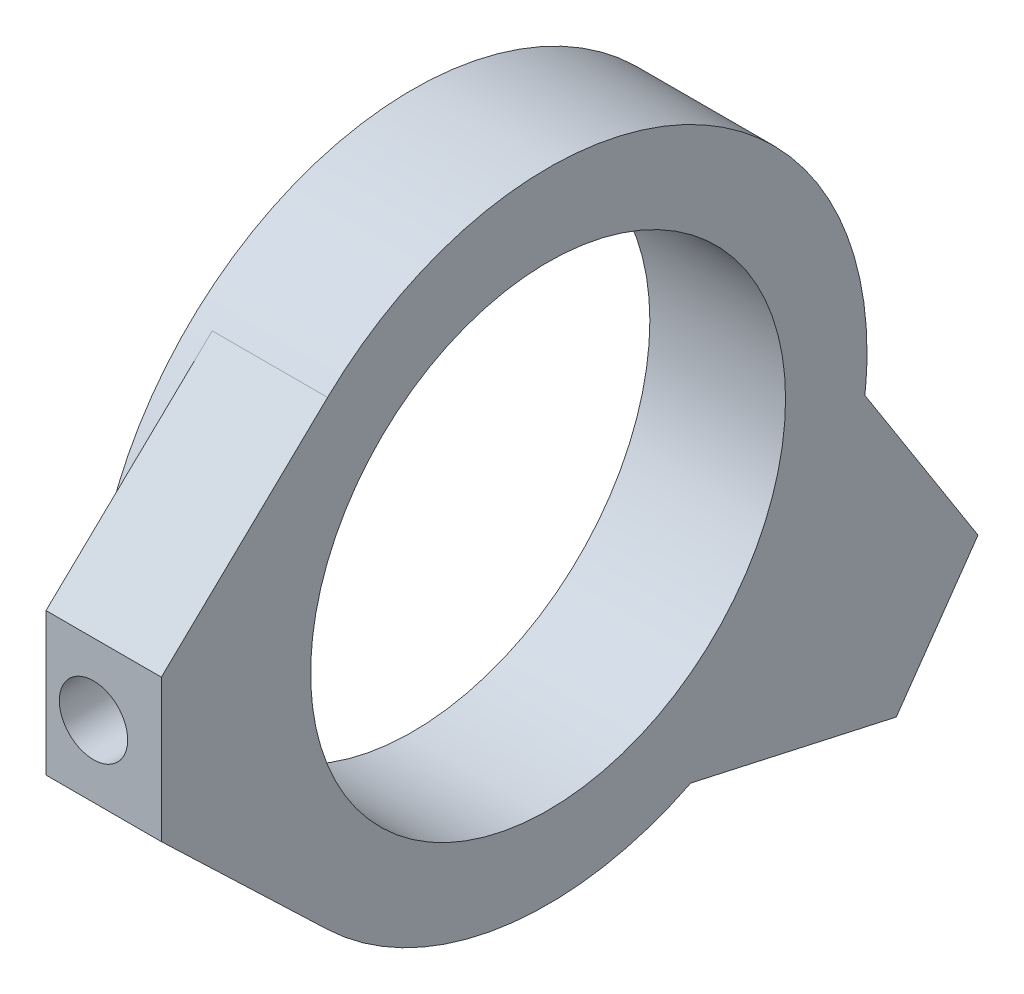
ISO-10303-21;
HEADER;
FILE_DESCRIPTION(('STEP AP214'),'2;1');
FILE_NAME('part.step','',(''),(''),'','','');
FILE_SCHEMA(('AUTOMOTIVE_DESIGN { 1 0 10303 214 1 1 1 1 }'));
ENDSEC;
DATA;
#1=APPLICATION_CONTEXT('core data for automotive mechanical design processes');
#2=APPLICATION_PROTOCOL_DEFINITION('international standard','automotive_design',2000,#1);
#3=PRODUCT_CONTEXT('',#1,'mechanical');
#4=PRODUCT('Part','Part','',(#3));
#5=PRODUCT_RELATED_PRODUCT_CATEGORY('part','',(#4));
#6=PRODUCT_DEFINITION_FORMATION('','',#4);
#7=PRODUCT_DEFINITION_CONTEXT('part definition',#1,'design');
#8=PRODUCT_DEFINITION('design','',#6,#7);
#9=PRODUCT_DEFINITION_SHAPE('','',#8);
#10=(LENGTH_UNIT() NAMED_UNIT(*) SI_UNIT(.MILLI.,.METRE.));
#11=(NAMED_UNIT(*) PLANE_ANGLE_UNIT() SI_UNIT($,.RADIAN.));
#12=(NAMED_UNIT(*) SI_UNIT($,.STERADIAN.) SOLID_ANGLE_UNIT());
#13=UNCERTAINTY_MEASURE_WITH_UNIT(LENGTH_MEASURE(1.E-05),#10,'distance_accuracy_value','');
#14=(GEOMETRIC_REPRESENTATION_CONTEXT(3) GLOBAL_UNCERTAINTY_ASSIGNED_CONTEXT((#13)) GLOBAL_UNIT_ASSIGNED_CONTEXT((#10,
#11,#12)) REPRESENTATION_CONTEXT('',''));
#15=CARTESIAN_POINT('',(0.,0.,0.));
#16=DIRECTION('',(0.,0.,1.));
#17=DIRECTION('',(1.,0.,0.));
#18=AXIS2_PLACEMENT_3D('',#15,#16,#17);
#19=CARTESIAN_POINT('',(124.,109.,97.1));
#20=DIRECTION('',(-1.,0.,0.));
#21=DIRECTION('',(0.,-1.,0.));
#22=AXIS2_PLACEMENT_3D('',#19,#20,#21);
#23=CONICAL_SURFACE('',#22,29.5,0.321750554396647);
#24=CARTESIAN_POINT('',(124.,109.,97.1));
#25=DIRECTION('',(-1.,0.,0.));
#26=DIRECTION('',(0.,-1.,0.));
#27=AXIS2_PLACEMENT_3D('',#24,#25,#26);
#28=CIRCLE('',#27,29.5);
#29=CARTESIAN_POINT('',(124.,99.2513146979725,69.257350433516));
#30=VERTEX_POINT('',#29);
#31=CARTESIAN_POINT('',(124.,86.170714403484,78.4164853640246));
#32=VERTEX_POINT('',#31);
#33=EDGE_CURVE('E19',#30,#32,#28,.T.);
#34=ORIENTED_EDGE('',*,*,#33,.T.);
#35=CARTESIAN_POINT('',(125.5,86.309172831118,79.0410309709572));
#36=CARTESIAN_POINT('',(124.76049302439,86.2405353199829,78.7314271658099));
#37=CARTESIAN_POINT('',(124.,86.170714403484,78.4164853640246));
#38=B_SPLINE_CURVE_WITH_KNOTS('',2,(#35,#36,#37),.UNSPECIFIED.,.F.,.F.,(3,3),(0.,1.),.UNSPECIFIED.);
#39=CARTESIAN_POINT('',(125.5,86.309172831118,79.0410309709572));
#40=VERTEX_POINT('',#39);
#41=EDGE_CURVE('E76',#40,#32,#38,.T.);
#42=ORIENTED_EDGE('',*,*,#41,.F.);
#43=CARTESIAN_POINT('',(125.5,109.,97.1));
#44=DIRECTION('',(-1.,0.,0.));
#45=DIRECTION('',(0.,-1.,0.));
#46=AXIS2_PLACEMENT_3D('',#43,#44,#45);
#47=CIRCLE('',#46,29.);
#48=CARTESIAN_POINT('',(125.5,99.7908400248872,69.6010659742458));
#49=VERTEX_POINT('',#48);
#50=EDGE_CURVE('E123',#49,#40,#47,.T.);
#51=ORIENTED_EDGE('',*,*,#50,.F.);
#52=CARTESIAN_POINT('',(124.,99.2513146979725,69.257350433516));
#53=CARTESIAN_POINT('',(124.760493024394,99.5233830252203,69.4306770737132));
#54=CARTESIAN_POINT('',(125.5,99.7908400248872,69.6010659742458));
#55=B_SPLINE_CURVE_WITH_KNOTS('',2,(#52,#53,#54),.UNSPECIFIED.,.F.,.F.,(3,3),(0.,1.),.UNSPECIFIED.);
#56=EDGE_CURVE('E201',#30,#49,#55,.T.);
#57=ORIENTED_EDGE('',*,*,#56,.F.);
#58=EDGE_LOOP('',(#34,#42,#51,#57));
#59=FACE_BOUND('',#58,.T.);
#60=ADVANCED_FACE('F16',(#59),#23,.F.);
#61=CARTESIAN_POINT('',(124.,108.562138247598,95.5092010795212));
#62=DIRECTION('',(1.,0.,0.));
#63=DIRECTION('',(0.,0.,-1.));
#64=AXIS2_PLACEMENT_3D('',#61,#62,#63);
#65=PLANE('',#64);
#66=DIRECTION('',(0.,0.843391445812876,0.53729960834684));
#67=VECTOR('',#66,1.);
#68=CARTESIAN_POINT('',(124.,93.2253729602315,65.4184021590424));
#69=LINE('',#68,#67);
#70=CARTESIAN_POINT('',(124.,93.2253729602315,65.4184021590424));
#71=VERTEX_POINT('',#70);
#72=EDGE_CURVE('E212',#71,#30,#69,.T.);
#73=ORIENTED_EDGE('',*,*,#72,.F.);
#74=DIRECTION('',(0.,0.819152044289003,-0.57357643635103));
#75=VECTOR('',#74,1.);
#76=CARTESIAN_POINT('',(124.,84.624276495197,71.4409547407282));
#77=LINE('',#76,#75);
#78=CARTESIAN_POINT('',(124.,84.624276495197,71.4409547407282));
#79=VERTEX_POINT('',#78);
#80=EDGE_CURVE('E144',#79,#71,#77,.T.);
#81=ORIENTED_EDGE('',*,*,#80,.F.);
#82=DIRECTION('',(0.,-0.216439613938084,-0.976296007119938));
#83=VECTOR('',#82,1.);
#84=CARTESIAN_POINT('',(124.,87.982266672573,86.5878695890335));
#85=LINE('',#84,#83);
#86=EDGE_CURVE('E83',#32,#79,#85,.T.);
#87=ORIENTED_EDGE('',*,*,#86,.F.);
#88=ORIENTED_EDGE('',*,*,#33,.F.);
#89=EDGE_LOOP('',(#73,#81,#87,#88));
#90=FACE_BOUND('',#89,.T.);
#91=ADVANCED_FACE('F290',(#90),#65,.F.);
#92=CARTESIAN_POINT('',(125.5,96.3097448101109,78.0944677816397));
#93=DIRECTION('',(-1.,0.,0.));
#94=DIRECTION('',(0.,0.,1.));
#95=AXIS2_PLACEMENT_3D('',#92,#93,#94);
#96=PLANE('',#95);
#97=DIRECTION('',(0.,-0.216439613938084,-0.976296007119938));
#98=VECTOR('',#97,1.);
#99=CARTESIAN_POINT('',(125.5,87.982266672573,86.5878695890335));
#100=LINE('',#99,#98);
#101=CARTESIAN_POINT('',(125.5,87.982266672573,86.5878695890335));
#102=VERTEX_POINT('',#101);
#103=EDGE_CURVE('E147',#102,#40,#100,.T.);
#104=ORIENTED_EDGE('',*,*,#103,.F.);
#105=CARTESIAN_POINT('',(125.5,109.,97.1));
#106=DIRECTION('',(1.,0.,0.));
#107=DIRECTION('',(0.,0.,-1.));
#108=AXIS2_PLACEMENT_3D('',#105,#106,#107);
#109=CIRCLE('',#108,23.5);
#110=CARTESIAN_POINT('',(125.5,106.310316789104,73.7544307367538));
#111=VERTEX_POINT('',#110);
#112=EDGE_CURVE('E195',#111,#102,#109,.F.);
#113=ORIENTED_EDGE('',*,*,#112,.F.);
#114=DIRECTION('',(0.,0.843391445812876,0.53729960834684));
#115=VECTOR('',#114,1.);
#116=CARTESIAN_POINT('',(125.5,93.2253729602315,65.4184021590424));
#117=LINE('',#116,#115);
#118=EDGE_CURVE('E278',#49,#111,#117,.T.);
#119=ORIENTED_EDGE('',*,*,#118,.F.);
#120=ORIENTED_EDGE('',*,*,#50,.T.);
#121=EDGE_LOOP('',(#104,#113,#119,#120));
#122=FACE_BOUND('',#121,.T.);
#123=ADVANCED_FACE('F292',(#122),#96,.T.);
#124=CARTESIAN_POINT('',(125.5,109.,119.475011669298));
#125=DIRECTION('',(-1.,0.,0.));
#126=DIRECTION('',(0.,0.,1.));
#127=AXIS2_PLACEMENT_3D('',#124,#125,#126);
#128=PLANE('',#127);
#129=CARTESIAN_POINT('',(125.5,109.,97.1));
#130=DIRECTION('',(1.,0.,0.));
#131=DIRECTION('',(0.,0.,-1.));
#132=AXIS2_PLACEMENT_3D('',#129,#130,#131);
#133=CIRCLE('',#132,23.5);
#134=CARTESIAN_POINT('',(125.5,92.0239362190439,113.350023338596));
#135=VERTEX_POINT('',#134);
#136=CARTESIAN_POINT('',(125.5,125.976063780956,113.350023338596));
#137=VERTEX_POINT('',#136);
#138=EDGE_CURVE('E119',#135,#137,#133,.F.);
#139=ORIENTED_EDGE('',*,*,#138,.F.);
#140=DIRECTION('',(0.,-0.691490354833863,-0.722385692806646));
#141=VECTOR('',#140,1.);
#142=CARTESIAN_POINT('',(125.5,103.75,125.6));
#143=LINE('',#142,#141);
#144=CARTESIAN_POINT('',(125.5,103.75,125.6));
#145=VERTEX_POINT('',#144);
#146=EDGE_CURVE('E117',#145,#135,#143,.T.);
#147=ORIENTED_EDGE('',*,*,#146,.F.);
#148=DIRECTION('',(0.,-1.,0.));
#149=VECTOR('',#148,1.);
#150=CARTESIAN_POINT('',(125.5,114.25,125.6));
#151=LINE('',#150,#149);
#152=CARTESIAN_POINT('',(125.5,114.25,125.6));
#153=VERTEX_POINT('',#152);
#154=EDGE_CURVE('E105',#153,#145,#151,.T.);
#155=ORIENTED_EDGE('',*,*,#154,.F.);
#156=DIRECTION('',(0.,-0.691490354833863,0.722385692806646));
#157=VECTOR('',#156,1.);
#158=CARTESIAN_POINT('',(125.5,125.976063780956,113.350023338596));
#159=LINE('',#158,#157);
#160=EDGE_CURVE('E136',#137,#153,#159,.T.);
#161=ORIENTED_EDGE('',*,*,#160,.F.);
#162=EDGE_LOOP('',(#139,#147,#155,#161));
#163=FACE_BOUND('',#162,.T.);
#164=ADVANCED_FACE('F118',(#163),#128,.T.);
#165=CARTESIAN_POINT('',(124.,103.75,125.6));
#166=DIRECTION('',(0.,-0.722385692806646,0.691490354833863));
#167=DIRECTION('',(0.,-0.691490354833863,-0.722385692806646));
#168=AXIS2_PLACEMENT_3D('',#165,#166,#167);
#169=PLANE('',#168);
#170=DIRECTION('',(0.,-0.691490354833871,-0.722385692806639));
#171=VECTOR('',#170,1.);
#172=CARTESIAN_POINT('',(134.,103.75,125.6));
#173=LINE('',#172,#171);
#174=CARTESIAN_POINT('',(134.,103.75,125.6));
#175=VERTEX_POINT('',#174);
#176=CARTESIAN_POINT('',(134.,92.0239362190439,113.350023338596));
#177=VERTEX_POINT('',#176);
#178=EDGE_CURVE('E127',#175,#177,#173,.T.);
#179=ORIENTED_EDGE('',*,*,#178,.F.);
#180=DIRECTION('',(1.,0.,0.));
#181=VECTOR('',#180,1.);
#182=CARTESIAN_POINT('',(124.,103.75,125.6));
#183=LINE('',#182,#181);
#184=EDGE_CURVE('E110',#145,#175,#183,.T.);
#185=ORIENTED_EDGE('',*,*,#184,.F.);
#186=ORIENTED_EDGE('',*,*,#146,.T.);
#187=DIRECTION('',(1.,0.,0.));
#188=VECTOR('',#187,1.);
#189=CARTESIAN_POINT('',(124.,92.0239362190439,113.350023338596));
#190=LINE('',#189,#188);
#191=EDGE_CURVE('E194',#177,#135,#190,.F.);
#192=ORIENTED_EDGE('',*,*,#191,.F.);
#193=EDGE_LOOP('',(#179,#185,#186,#192));
#194=FACE_BOUND('',#193,.T.);
#195=ADVANCED_FACE('F126',(#194),#169,.T.);
#196=CARTESIAN_POINT('',(124.,87.982266672573,86.5878695890335));
#197=DIRECTION('',(0.,-0.976296007119938,0.216439613938084));
#198=DIRECTION('',(0.,-0.216439613938084,-0.976296007119938));
#199=AXIS2_PLACEMENT_3D('',#196,#197,#198);
#200=PLANE('',#199);
#201=DIRECTION('',(1.,0.,0.));
#202=VECTOR('',#201,1.);
#203=CARTESIAN_POINT('',(124.,87.9822666725731,86.5878695890335));
#204=LINE('',#203,#202);
#205=CARTESIAN_POINT('',(134.,87.982266672573,86.5878695890335));
#206=VERTEX_POINT('',#205);
#207=EDGE_CURVE('E196',#102,#206,#204,.T.);
#208=ORIENTED_EDGE('',*,*,#207,.F.);
#209=ORIENTED_EDGE('',*,*,#103,.T.);
#210=ORIENTED_EDGE('',*,*,#41,.T.);
#211=ORIENTED_EDGE('',*,*,#86,.T.);
#212=DIRECTION('',(1.,0.,0.));
#213=VECTOR('',#212,1.);
#214=CARTESIAN_POINT('',(124.,84.624276495197,71.4409547407282));
#215=LINE('',#214,#213);
#216=CARTESIAN_POINT('',(134.,84.624276495197,71.4409547407282));
#217=VERTEX_POINT('',#216);
#218=EDGE_CURVE('E146',#217,#79,#215,.F.);
#219=ORIENTED_EDGE('',*,*,#218,.F.);
#220=DIRECTION('',(0.,-0.21643961393808,-0.976296007119938));
#221=VECTOR('',#220,1.);
#222=CARTESIAN_POINT('',(134.,87.982266672573,86.5878695890335));
#223=LINE('',#222,#221);
#224=EDGE_CURVE('E189',#206,#217,#223,.T.);
#225=ORIENTED_EDGE('',*,*,#224,.F.);
#226=EDGE_LOOP('',(#208,#209,#210,#211,#219,#225));
#227=FACE_BOUND('',#226,.T.);
#228=ADVANCED_FACE('F229',(#227),#200,.T.);
#229=CARTESIAN_POINT('',(124.,84.624276495197,71.4409547407282));
#230=DIRECTION('',(0.,-0.57357643635103,-0.819152044289003));
#231=DIRECTION('',(0.,0.819152044289003,-0.57357643635103));
#232=AXIS2_PLACEMENT_3D('',#229,#230,#231);
#233=PLANE('',#232);
#234=DIRECTION('',(0.,0.819152044289003,-0.57357643635103));
#235=VECTOR('',#234,1.);
#236=CARTESIAN_POINT('',(134.,84.624276495197,71.4409547407282));
#237=LINE('',#236,#235);
#238=CARTESIAN_POINT('',(134.,93.2253729602315,65.4184021590424));
#239=VERTEX_POINT('',#238);
#240=EDGE_CURVE('E256',#217,#239,#237,.T.);
#241=ORIENTED_EDGE('',*,*,#240,.F.);
#242=ORIENTED_EDGE('',*,*,#218,.T.);
#243=ORIENTED_EDGE('',*,*,#80,.T.);
#244=DIRECTION('',(1.,0.,0.));
#245=VECTOR('',#244,1.);
#246=CARTESIAN_POINT('',(124.,93.2253729602315,65.4184021590424));
#247=LINE('',#246,#245);
#248=EDGE_CURVE('E280',#239,#71,#247,.F.);
#249=ORIENTED_EDGE('',*,*,#248,.F.);
#250=EDGE_LOOP('',(#241,#242,#243,#249));
#251=FACE_BOUND('',#250,.T.);
#252=ADVANCED_FACE('F225',(#251),#233,.T.);
#253=CARTESIAN_POINT('',(124.,93.2253729602315,65.4184021590424));
#254=DIRECTION('',(0.,0.53729960834684,-0.843391445812876));
#255=DIRECTION('',(0.,0.843391445812876,0.53729960834684));
#256=AXIS2_PLACEMENT_3D('',#253,#254,#255);
#257=PLANE('',#256);
#258=ORIENTED_EDGE('',*,*,#248,.T.);
#259=ORIENTED_EDGE('',*,*,#72,.T.);
#260=ORIENTED_EDGE('',*,*,#56,.T.);
#261=ORIENTED_EDGE('',*,*,#118,.T.);
#262=DIRECTION('',(1.,0.,0.));
#263=VECTOR('',#262,1.);
#264=CARTESIAN_POINT('',(124.,106.310316789104,73.7544307367538));
#265=LINE('',#264,#263);
#266=CARTESIAN_POINT('',(134.,106.310316789104,73.7544307367538));
#267=VERTEX_POINT('',#266);
#268=EDGE_CURVE('E197',#267,#111,#265,.F.);
#269=ORIENTED_EDGE('',*,*,#268,.F.);
#270=DIRECTION('',(0.,0.84339144581288,0.537299608346833));
#271=VECTOR('',#270,1.);
#272=CARTESIAN_POINT('',(134.,93.2253729602315,65.4184021590424));
#273=LINE('',#272,#271);
#274=EDGE_CURVE('E185',#239,#267,#273,.T.);
#275=ORIENTED_EDGE('',*,*,#274,.F.);
#276=EDGE_LOOP('',(#258,#259,#260,#261,#269,#275));
#277=FACE_BOUND('',#276,.T.);
#278=ADVANCED_FACE('F214',(#277),#257,.T.);
#279=CARTESIAN_POINT('',(124.,109.,97.1));
#280=DIRECTION('',(1.,0.,0.));
#281=DIRECTION('',(0.,0.,-1.));
#282=AXIS2_PLACEMENT_3D('',#279,#280,#281);
#283=CYLINDRICAL_SURFACE('',#282,23.5);
#284=CARTESIAN_POINT('',(124.,109.,97.1));
#285=DIRECTION('',(1.,0.,0.));
#286=DIRECTION('',(0.,0.,-1.));
#287=AXIS2_PLACEMENT_3D('',#284,#285,#286);
#288=CIRCLE('',#287,23.5);
#289=CARTESIAN_POINT('',(124.,109.,73.6));
#290=VERTEX_POINT('',#289);
#291=EDGE_CURVE('E129',#290,#290,#288,.T.);
#292=ORIENTED_EDGE('',*,*,#291,.T.);
#293=EDGE_LOOP('',(#292));
#294=FACE_BOUND('',#293,.T.);
#295=ORIENTED_EDGE('',*,*,#191,.T.);
#296=ORIENTED_EDGE('',*,*,#138,.T.);
#297=DIRECTION('',(1.,0.,0.));
#298=VECTOR('',#297,1.);
#299=CARTESIAN_POINT('',(124.,125.976063780956,113.350023338596));
#300=LINE('',#299,#298);
#301=CARTESIAN_POINT('',(134.,125.976063780956,113.350023338596));
#302=VERTEX_POINT('',#301);
#303=EDGE_CURVE('E114',#302,#137,#300,.F.);
#304=ORIENTED_EDGE('',*,*,#303,.F.);
#305=CARTESIAN_POINT('',(134.,109.,97.1));
#306=DIRECTION('',(1.,0.,0.));
#307=DIRECTION('',(0.,0.,-1.));
#308=AXIS2_PLACEMENT_3D('',#305,#306,#307);
#309=CIRCLE('',#308,23.5);
#310=EDGE_CURVE('E34',#267,#302,#309,.T.);
#311=ORIENTED_EDGE('',*,*,#310,.F.);
#312=ORIENTED_EDGE('',*,*,#268,.T.);
#313=ORIENTED_EDGE('',*,*,#112,.T.);
#314=ORIENTED_EDGE('',*,*,#207,.T.);
#315=CARTESIAN_POINT('',(134.,109.,97.1));
#316=DIRECTION('',(1.,0.,0.));
#317=DIRECTION('',(0.,0.,-1.));
#318=AXIS2_PLACEMENT_3D('',#315,#316,#317);
#319=CIRCLE('',#318,23.5);
#320=EDGE_CURVE('E186',#177,#206,#319,.T.);
#321=ORIENTED_EDGE('',*,*,#320,.F.);
#322=EDGE_LOOP('',(#295,#296,#304,#311,#312,#313,#314,#321));
#323=FACE_BOUND('',#322,.T.);
#324=ADVANCED_FACE('F224',(#294,#323),#283,.T.);
#325=CARTESIAN_POINT('',(124.,125.976063780956,113.350023338596));
#326=DIRECTION('',(0.,0.722385692806646,0.691490354833863));
#327=DIRECTION('',(0.,-0.691490354833863,0.722385692806646));
#328=AXIS2_PLACEMENT_3D('',#325,#326,#327);
#329=PLANE('',#328);
#330=DIRECTION('',(0.,-0.691490354833865,0.722385692806645));
#331=VECTOR('',#330,1.);
#332=CARTESIAN_POINT('',(134.,125.976063780956,113.350023338596));
#333=LINE('',#332,#331);
#334=CARTESIAN_POINT('',(134.,114.25,125.6));
#335=VERTEX_POINT('',#334);
#336=EDGE_CURVE('E181',#302,#335,#333,.T.);
#337=ORIENTED_EDGE('',*,*,#336,.F.);
#338=ORIENTED_EDGE('',*,*,#303,.T.);
#339=ORIENTED_EDGE('',*,*,#160,.T.);
#340=DIRECTION('',(1.,0.,0.));
#341=VECTOR('',#340,1.);
#342=CARTESIAN_POINT('',(124.,114.25,125.6));
#343=LINE('',#342,#341);
#344=EDGE_CURVE('E101',#335,#153,#343,.F.);
#345=ORIENTED_EDGE('',*,*,#344,.F.);
#346=EDGE_LOOP('',(#337,#338,#339,#345));
#347=FACE_BOUND('',#346,.T.);
#348=ADVANCED_FACE('F324',(#347),#329,.T.);
#349=CARTESIAN_POINT('',(124.,114.25,125.6));
#350=DIRECTION('',(0.,0.,1.));
#351=DIRECTION('',(0.,-1.,0.));
#352=AXIS2_PLACEMENT_3D('',#349,#350,#351);
#353=PLANE('',#352);
#354=CARTESIAN_POINT('',(129.,109.,125.6));
#355=DIRECTION('',(0.,0.,-1.));
#356=DIRECTION('',(0.,1.,0.));
#357=AXIS2_PLACEMENT_3D('',#354,#355,#356);
#358=CIRCLE('',#357,2.5175);
#359=CARTESIAN_POINT('',(129.,111.5175,125.6));
#360=VERTEX_POINT('',#359);
#361=EDGE_CURVE('E178',#360,#360,#358,.T.);
#362=ORIENTED_EDGE('',*,*,#361,.T.);
#363=EDGE_LOOP('',(#362));
#364=FACE_BOUND('',#363,.T.);
#365=DIRECTION('',(0.,1.,0.));
#366=VECTOR('',#365,1.);
#367=CARTESIAN_POINT('',(134.,108.562138247598,125.6));
#368=LINE('',#367,#366);
#369=EDGE_CURVE('E192',#335,#175,#368,.F.);
#370=ORIENTED_EDGE('',*,*,#369,.F.);
#371=ORIENTED_EDGE('',*,*,#344,.T.);
#372=ORIENTED_EDGE('',*,*,#154,.T.);
#373=ORIENTED_EDGE('',*,*,#184,.T.);
#374=EDGE_LOOP('',(#370,#371,#372,#373));
#375=FACE_BOUND('',#374,.T.);
#376=ADVANCED_FACE('F108',(#364,#375),#353,.T.);
#377=CARTESIAN_POINT('',(124.,108.562138247598,95.5092010795212));
#378=DIRECTION('',(1.,0.,0.));
#379=DIRECTION('',(0.,0.,-1.));
#380=AXIS2_PLACEMENT_3D('',#377,#378,#379);
#381=PLANE('',#380);
#382=CARTESIAN_POINT('',(124.,109.,97.1));
#383=DIRECTION('',(1.,0.,0.));
#384=DIRECTION('',(0.,0.,-1.));
#385=AXIS2_PLACEMENT_3D('',#382,#383,#384);
#386=CIRCLE('',#385,17.5);
#387=CARTESIAN_POINT('',(124.,109.,79.6));
#388=VERTEX_POINT('',#387);
#389=EDGE_CURVE('E172',#388,#388,#386,.T.);
#390=ORIENTED_EDGE('',*,*,#389,.T.);
#391=EDGE_LOOP('',(#390));
#392=FACE_BOUND('',#391,.T.);
#393=ORIENTED_EDGE('',*,*,#291,.F.);
#394=EDGE_LOOP('',(#393));
#395=FACE_BOUND('',#394,.T.);
#396=ADVANCED_FACE('F336',(#392,#395),#381,.F.);
#397=CARTESIAN_POINT('',(134.,108.562138247598,95.5092010795212));
#398=DIRECTION('',(1.,0.,0.));
#399=DIRECTION('',(0.,0.,-1.));
#400=AXIS2_PLACEMENT_3D('',#397,#398,#399);
#401=PLANE('',#400);
#402=CARTESIAN_POINT('',(134.,109.,97.1));
#403=DIRECTION('',(1.,0.,0.));
#404=DIRECTION('',(0.,0.,-1.));
#405=AXIS2_PLACEMENT_3D('',#402,#403,#404);
#406=CIRCLE('',#405,17.5);
#407=CARTESIAN_POINT('',(134.,109.,79.6));
#408=VERTEX_POINT('',#407);
#409=EDGE_CURVE('E25',#408,#408,#406,.F.);
#410=ORIENTED_EDGE('',*,*,#409,.T.);
#411=EDGE_LOOP('',(#410));
#412=FACE_BOUND('',#411,.T.);
#413=ORIENTED_EDGE('',*,*,#310,.T.);
#414=ORIENTED_EDGE('',*,*,#336,.T.);
#415=ORIENTED_EDGE('',*,*,#369,.T.);
#416=ORIENTED_EDGE('',*,*,#178,.T.);
#417=ORIENTED_EDGE('',*,*,#320,.T.);
#418=ORIENTED_EDGE('',*,*,#224,.T.);
#419=ORIENTED_EDGE('',*,*,#240,.T.);
#420=ORIENTED_EDGE('',*,*,#274,.T.);
#421=EDGE_LOOP('',(#413,#414,#415,#416,#417,#418,#419,#420));
#422=FACE_BOUND('',#421,.T.);
#423=ADVANCED_FACE('F167',(#412,#422),#401,.T.);
#424=CARTESIAN_POINT('',(129.,109.,100.3));
#425=DIRECTION('',(0.,0.,-1.));
#426=DIRECTION('',(0.,1.,0.));
#427=AXIS2_PLACEMENT_3D('',#424,#425,#426);
#428=CYLINDRICAL_SURFACE('',#427,2.5175);
#429=CARTESIAN_POINT('',(129.,111.5175,114.417973142086));
#430=CARTESIAN_POINT('',(129.140613739069,111.517493924197,114.417975496803));
#431=CARTESIAN_POINT('',(129.281316628551,111.505678691639,114.419704341234));
#432=CARTESIAN_POINT('',(129.558799795782,111.458737634532,114.426429216396));
#433=CARTESIAN_POINT('',(129.69557575243,111.423587086237,114.431428712297));
#434=CARTESIAN_POINT('',(129.961138377849,111.331044688405,114.444117090304));
#435=CARTESIAN_POINT('',(130.089931112993,111.273669973235,114.451803900102));
#436=CARTESIAN_POINT('',(130.336039225481,111.138346902957,114.468998324117));
#437=CARTESIAN_POINT('',(130.453356445336,111.06040185808,114.478505645304));
#438=CARTESIAN_POINT('',(130.674071110158,110.885535638154,114.498348400435));
#439=CARTESIAN_POINT('',(130.777371609802,110.788492657155,114.508688884169));
#440=CARTESIAN_POINT('',(130.966281177921,110.578447913321,114.528987720426));
#441=CARTESIAN_POINT('',(131.051889253292,110.465445255242,114.538946051471));
#442=CARTESIAN_POINT('',(131.203338477501,110.226071478752,114.557411032797));
#443=CARTESIAN_POINT('',(131.26909082133,110.099643622442,114.565911089898));
#444=CARTESIAN_POINT('',(131.378392484145,109.837396368262,114.580446031848));
#445=CARTESIAN_POINT('',(131.421942889804,109.701577430408,114.586481037345));
#446=CARTESIAN_POINT('',(131.485311859482,109.425399406992,114.595370318047));
#447=CARTESIAN_POINT('',(131.505292366505,109.285078188776,114.598246288683));
#448=CARTESIAN_POINT('',(131.521456957301,109.00304719333,114.600567745008));
#449=CARTESIAN_POINT('',(131.517642264136,108.861337487841,114.600013407012));
#450=CARTESIAN_POINT('',(131.486453063397,108.58165621857,114.59555409702));
#451=CARTESIAN_POINT('',(131.459252768261,108.44366477615,114.591673901846));
#452=CARTESIAN_POINT('',(131.382337640183,108.174225489809,114.581026489831));
#453=CARTESIAN_POINT('',(131.332622264875,108.042777803604,114.574259203443));
#454=CARTESIAN_POINT('',(131.211908062795,107.789626904907,114.558555326356));
#455=CARTESIAN_POINT('',(131.140835360139,107.667959404647,114.549611226719));
#456=CARTESIAN_POINT('',(130.979477881383,107.43821202544,114.530551562716));
#457=CARTESIAN_POINT('',(130.889191941562,107.330132970157,114.520435927409));
#458=CARTESIAN_POINT('',(130.690998979789,107.129604390759,114.500054328517));
#459=CARTESIAN_POINT('',(130.582939922414,107.03730512105,114.489787832873));
#460=CARTESIAN_POINT('',(130.352786150321,106.872127995759,114.470351156925));
#461=CARTESIAN_POINT('',(130.230691360852,106.799250243621,114.46118098246));
#462=CARTESIAN_POINT('',(129.97578131421,106.67496768683,114.444975484191));
#463=CARTESIAN_POINT('',(129.842958866207,106.623577430354,114.437941607653));
#464=CARTESIAN_POINT('',(129.570444786034,106.543875092774,114.426831360304));
#465=CARTESIAN_POINT('',(129.430753598877,106.515561518651,114.422754798164));
#466=CARTESIAN_POINT('',(129.149801604724,106.483020457822,114.418056648723));
#467=CARTESIAN_POINT('',(129.0085659126,106.478580381027,114.417404568122));
#468=CARTESIAN_POINT('',(128.72736649436,106.493349083832,114.419548339712));
#469=CARTESIAN_POINT('',(128.587402732278,106.51255719261,114.422344094098));
#470=CARTESIAN_POINT('',(128.313373280755,106.573897038717,114.43104056188));
#471=CARTESIAN_POINT('',(128.179283563275,106.615923629029,114.436927029274));
#472=CARTESIAN_POINT('',(127.920052209134,106.721598435992,114.451129986487));
#473=CARTESIAN_POINT('',(127.79491099242,106.785247666575,114.459446590257));
#474=CARTESIAN_POINT('',(127.556173292682,106.932875235602,114.4776449474));
#475=CARTESIAN_POINT('',(127.442663063078,107.016991747241,114.487537173891));
#476=CARTESIAN_POINT('',(127.231295569633,107.202972032926,114.507740180764));
#477=CARTESIAN_POINT('',(127.133438967594,107.304836556941,114.518050978819));
#478=CARTESIAN_POINT('',(126.955397824815,107.524354638403,114.538024128041));
#479=CARTESIAN_POINT('',(126.875353466335,107.642122474087,114.547680946113));
#480=CARTESIAN_POINT('',(126.736180717136,107.889559722797,114.565173523651));
#481=CARTESIAN_POINT('',(126.677052876839,108.019229448911,114.573009235193));
#482=CARTESIAN_POINT('',(126.580850917784,108.28850823632,114.586056121626));
#483=CARTESIAN_POINT('',(126.544066108363,108.428222525355,114.591232738198));
#484=CARTESIAN_POINT('',(126.494891721225,108.711960294251,114.598204445321));
#485=CARTESIAN_POINT('',(126.482500732727,108.855983524422,114.599999731426));
#486=CARTESIAN_POINT('',(126.482499283864,109.140755358836,114.600000262493));
#487=CARTESIAN_POINT('',(126.494334045418,109.281504265518,114.598285879999));
#488=CARTESIAN_POINT('',(126.541310363094,109.558970934219,114.591621256759));
#489=CARTESIAN_POINT('',(126.576450885337,109.695688874776,114.586671159552));
#490=CARTESIAN_POINT('',(126.668975644594,109.961192568842,114.574088899023));
#491=CARTESIAN_POINT('',(126.726353138535,110.089980713251,114.56645754882));
#492=CARTESIAN_POINT('',(126.861693937845,110.336105929856,114.549356971395));
#493=CARTESIAN_POINT('',(126.939657813026,110.453442684965,114.539887693303));
#494=CARTESIAN_POINT('',(127.114536050339,110.674150593205,114.520091667399));
#495=CARTESIAN_POINT('',(127.21156604273,110.777429675924,114.509759920626));
#496=CARTESIAN_POINT('',(127.42159959811,110.966318632645,114.489440481321));
#497=CARTESIAN_POINT('',(127.534606998931,111.051924249226,114.479452872171));
#498=CARTESIAN_POINT('',(127.774041689797,111.203408131913,114.460900416988));
#499=CARTESIAN_POINT('',(127.90053275353,111.269186459049,114.452342872484));
#500=CARTESIAN_POINT('',(128.162823325241,111.378461913778,114.437704180451));
#501=CARTESIAN_POINT('',(128.298612234334,111.421983947861,114.431620266312));
#502=CARTESIAN_POINT('',(128.529278669653,111.474914394466,114.424122787743));
#503=CARTESIAN_POINT('',(128.622679780048,111.490860877427,114.421828112072));
#504=CARTESIAN_POINT('',(128.810707132475,111.512155673525,114.418752504013));
#505=CARTESIAN_POINT('',(128.905333362498,111.517504090467,114.417971556798));
#506=CARTESIAN_POINT('',(129.,111.5175,114.417973142086));
#507=B_SPLINE_CURVE_WITH_KNOTS('',3,(#429,#430,#431,#432,#433,#434,#435,#436,#437,#438,#439,
#440,#441,#442,#443,#444,#445,#446,#447,#448,#449,#450,#451,#452,#453,#454,#455,#456,#457,#458,
#459,#460,#461,#462,#463,#464,#465,#466,#467,#468,#469,#470,#471,#472,#473,#474,#475,#476,#477,
#478,#479,#480,#481,#482,#483,#484,#485,#486,#487,#488,#489,#490,#491,#492,#493,#494,#495,#496,
#497,#498,#499,#500,#501,#502,#503,#504,#505,#506),.UNSPECIFIED.,.T.,.F.,(4,2,2,2,2,2,2,2,2,2,2,
2,2,2,2,2,2,2,2,2,2,2,2,2,2,2,2,2,2,2,2,2,2,2,2,2,2,2,4),(0.,0.421494550709494,
0.843436388782568,1.26505356398727,1.68660293277462,2.11093355917809,2.53528799751375,
2.9615131761652,3.3877174912466,3.81097608171785,4.23421291708546,4.65432387669741,
5.07444495688191,5.49603631669454,5.91765321899485,6.34308468023879,6.76851840738543,
7.19423971117995,7.6199334694173,8.04183012962384,8.46371482225747,8.88367177806304,
9.30364842927016,9.72654306102551,10.1494555671584,10.575587117072,11.0017298798999,
11.4332790536903,11.8648032687682,12.2865560265411,12.7082900759876,13.1298963400119,
13.5515142749271,13.9757728382752,14.4001334837738,14.8265986544383,15.2525855279157,
15.5363548304973,15.8201213536342),.UNSPECIFIED.);
#508=CARTESIAN_POINT('',(129.,111.5175,114.417973142086));
#509=VERTEX_POINT('',#508);
#510=EDGE_CURVE('E11',#509,#509,#507,.T.);
#511=ORIENTED_EDGE('',*,*,#510,.T.);
#512=EDGE_LOOP('',(#511));
#513=FACE_BOUND('',#512,.T.);
#514=ORIENTED_EDGE('',*,*,#361,.F.);
#515=EDGE_LOOP('',(#514));
#516=FACE_BOUND('',#515,.T.);
#517=ADVANCED_FACE('F156',(#513,#516),#428,.F.);
#518=CARTESIAN_POINT('',(124.,109.,97.1));
#519=DIRECTION('',(1.,0.,0.));
#520=DIRECTION('',(0.,0.,-1.));
#521=AXIS2_PLACEMENT_3D('',#518,#519,#520);
#522=CYLINDRICAL_SURFACE('',#521,17.5);
#523=ORIENTED_EDGE('',*,*,#389,.F.);
#524=EDGE_LOOP('',(#523));
#525=FACE_BOUND('',#524,.T.);
#526=ORIENTED_EDGE('',*,*,#510,.F.);
#527=EDGE_LOOP('',(#526));
#528=FACE_BOUND('',#527,.T.);
#529=ORIENTED_EDGE('',*,*,#409,.F.);
#530=EDGE_LOOP('',(#529));
#531=FACE_BOUND('',#530,.T.);
#532=ADVANCED_FACE('F159',(#525,#528,#531),#522,.F.);
#533=CLOSED_SHELL('',(#60,#91,#123,#164,#195,#228,#252,#278,#324,#348,#376,#396,#423,#517,#532));
#534=MANIFOLD_SOLID_BREP('B1',#533);
#535=ADVANCED_BREP_SHAPE_REPRESENTATION('',(#18,#534),#14);
#536=SHAPE_DEFINITION_REPRESENTATION(#9,#535);
ENDSEC;
END-ISO-10303-21;
